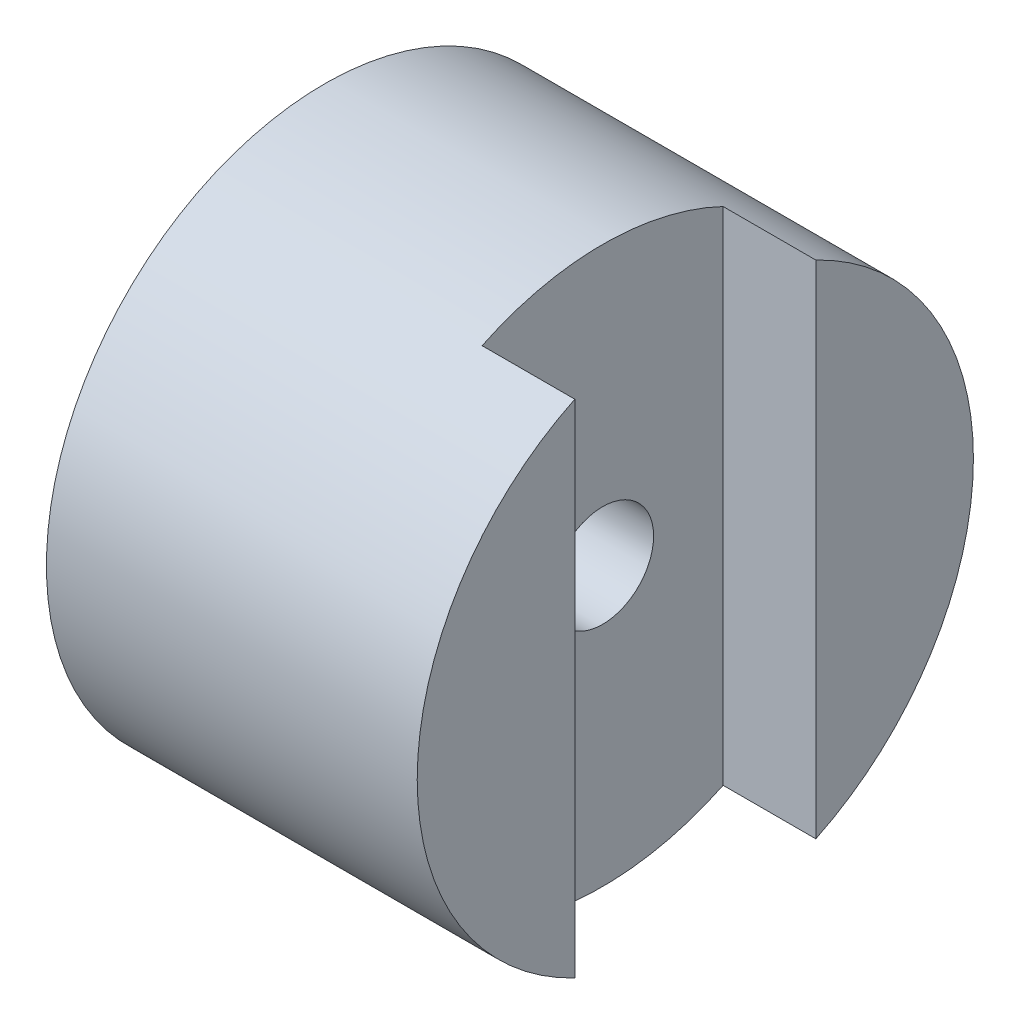
ISO-10303-21;
HEADER;
FILE_DESCRIPTION(('STEP AP214'),'2;1');
FILE_NAME('part.step','',(''),(''),'','','');
FILE_SCHEMA(('AUTOMOTIVE_DESIGN { 1 0 10303 214 1 1 1 1 }'));
ENDSEC;
DATA;
#1=APPLICATION_CONTEXT('core data for automotive mechanical design processes');
#2=APPLICATION_PROTOCOL_DEFINITION('international standard','automotive_design',2000,#1);
#3=PRODUCT_CONTEXT('',#1,'mechanical');
#4=PRODUCT('Part','Part','',(#3));
#5=PRODUCT_RELATED_PRODUCT_CATEGORY('part','',(#4));
#6=PRODUCT_DEFINITION_FORMATION('','',#4);
#7=PRODUCT_DEFINITION_CONTEXT('part definition',#1,'design');
#8=PRODUCT_DEFINITION('design','',#6,#7);
#9=PRODUCT_DEFINITION_SHAPE('','',#8);
#10=(LENGTH_UNIT() NAMED_UNIT(*) SI_UNIT(.MILLI.,.METRE.));
#11=(NAMED_UNIT(*) PLANE_ANGLE_UNIT() SI_UNIT($,.RADIAN.));
#12=(NAMED_UNIT(*) SI_UNIT($,.STERADIAN.) SOLID_ANGLE_UNIT());
#13=UNCERTAINTY_MEASURE_WITH_UNIT(LENGTH_MEASURE(1.E-05),#10,'distance_accuracy_value','');
#14=(GEOMETRIC_REPRESENTATION_CONTEXT(3) GLOBAL_UNCERTAINTY_ASSIGNED_CONTEXT((#13)) GLOBAL_UNIT_ASSIGNED_CONTEXT((#10,
#11,#12)) REPRESENTATION_CONTEXT('',''));
#15=CARTESIAN_POINT('',(0.,0.,0.));
#16=DIRECTION('',(0.,0.,1.));
#17=DIRECTION('',(1.,0.,0.));
#18=AXIS2_PLACEMENT_3D('',#15,#16,#17);
#19=CARTESIAN_POINT('',(0.,0.,0.));
#20=DIRECTION('',(1.,0.,0.));
#21=DIRECTION('',(0.,0.,-1.));
#22=AXIS2_PLACEMENT_3D('',#19,#20,#21);
#23=PLANE('',#22);
#24=CARTESIAN_POINT('',(0.,0.,0.));
#25=DIRECTION('',(1.,0.,0.));
#26=DIRECTION('',(0.,0.,-1.));
#27=AXIS2_PLACEMENT_3D('',#24,#25,#26);
#28=CIRCLE('',#27,1.1);
#29=CARTESIAN_POINT('',(0.,0.,-1.1));
#30=VERTEX_POINT('',#29);
#31=EDGE_CURVE('E127',#30,#30,#28,.T.);
#32=ORIENTED_EDGE('',*,*,#31,.F.);
#33=EDGE_LOOP('',(#32));
#34=FACE_BOUND('',#33,.T.);
#35=CARTESIAN_POINT('',(0.,0.,0.));
#36=DIRECTION('',(1.,0.,0.));
#37=DIRECTION('',(0.,0.,-1.));
#38=AXIS2_PLACEMENT_3D('',#35,#36,#37);
#39=CIRCLE('',#38,6.);
#40=CARTESIAN_POINT('',(0.,-5.40740233383831,2.6));
#41=VERTEX_POINT('',#40);
#42=CARTESIAN_POINT('',(0.,-5.40740233383831,-2.6));
#43=VERTEX_POINT('',#42);
#44=EDGE_CURVE('E36',#41,#43,#39,.T.);
#45=ORIENTED_EDGE('',*,*,#44,.T.);
#46=DIRECTION('',(0.,-1.,0.));
#47=VECTOR('',#46,1.);
#48=CARTESIAN_POINT('',(0.,-5.40740233383831,-2.6));
#49=LINE('',#48,#47);
#50=CARTESIAN_POINT('',(0.,5.40740233383831,-2.6));
#51=VERTEX_POINT('',#50);
#52=EDGE_CURVE('E83',#51,#43,#49,.T.);
#53=ORIENTED_EDGE('',*,*,#52,.F.);
#54=CARTESIAN_POINT('',(0.,5.40740233383831,2.6));
#55=VERTEX_POINT('',#54);
#56=EDGE_CURVE('E87',#51,#55,#39,.T.);
#57=ORIENTED_EDGE('',*,*,#56,.T.);
#58=DIRECTION('',(0.,1.,0.));
#59=VECTOR('',#58,1.);
#60=CARTESIAN_POINT('',(0.,5.40740233383831,2.6));
#61=LINE('',#60,#59);
#62=EDGE_CURVE('E55',#41,#55,#61,.T.);
#63=ORIENTED_EDGE('',*,*,#62,.F.);
#64=EDGE_LOOP('',(#45,#53,#57,#63));
#65=FACE_BOUND('',#64,.T.);
#66=ADVANCED_FACE('F32',(#34,#65),#23,.T.);
#67=CARTESIAN_POINT('',(-6.,0.,0.));
#68=DIRECTION('',(1.,0.,0.));
#69=DIRECTION('',(0.,0.,-1.));
#70=AXIS2_PLACEMENT_3D('',#67,#68,#69);
#71=CYLINDRICAL_SURFACE('',#70,6.);
#72=CARTESIAN_POINT('',(-6.,0.,0.));
#73=DIRECTION('',(1.,0.,0.));
#74=DIRECTION('',(0.,0.,-1.));
#75=AXIS2_PLACEMENT_3D('',#72,#73,#74);
#76=CIRCLE('',#75,6.);
#77=CARTESIAN_POINT('',(-6.,0.,-6.));
#78=VERTEX_POINT('',#77);
#79=EDGE_CURVE('E11',#78,#78,#76,.T.);
#80=ORIENTED_EDGE('',*,*,#79,.T.);
#81=EDGE_LOOP('',(#80));
#82=FACE_BOUND('',#81,.T.);
#83=ORIENTED_EDGE('',*,*,#44,.F.);
#84=DIRECTION('',(-1.,0.,0.));
#85=VECTOR('',#84,1.);
#86=CARTESIAN_POINT('',(2.,-5.40740233383831,2.6));
#87=LINE('',#86,#85);
#88=CARTESIAN_POINT('',(2.,-5.40740233383831,2.6));
#89=VERTEX_POINT('',#88);
#90=EDGE_CURVE('E100',#89,#41,#87,.T.);
#91=ORIENTED_EDGE('',*,*,#90,.F.);
#92=CARTESIAN_POINT('',(2.,0.,0.));
#93=DIRECTION('',(1.,0.,0.));
#94=DIRECTION('',(0.,0.,-1.));
#95=AXIS2_PLACEMENT_3D('',#92,#93,#94);
#96=CIRCLE('',#95,6.);
#97=CARTESIAN_POINT('',(2.,5.40740233383831,2.6));
#98=VERTEX_POINT('',#97);
#99=EDGE_CURVE('E89',#98,#89,#96,.T.);
#100=ORIENTED_EDGE('',*,*,#99,.F.);
#101=DIRECTION('',(-1.,0.,0.));
#102=VECTOR('',#101,1.);
#103=CARTESIAN_POINT('',(2.,5.40740233383831,2.6));
#104=LINE('',#103,#102);
#105=EDGE_CURVE('E97',#98,#55,#104,.T.);
#106=ORIENTED_EDGE('',*,*,#105,.T.);
#107=ORIENTED_EDGE('',*,*,#56,.F.);
#108=DIRECTION('',(-1.,0.,0.));
#109=VECTOR('',#108,1.);
#110=CARTESIAN_POINT('',(2.,5.40740233383831,-2.6));
#111=LINE('',#110,#109);
#112=CARTESIAN_POINT('',(2.,5.40740233383831,-2.6));
#113=VERTEX_POINT('',#112);
#114=EDGE_CURVE('E47',#113,#51,#111,.T.);
#115=ORIENTED_EDGE('',*,*,#114,.F.);
#116=CARTESIAN_POINT('',(2.,0.,0.));
#117=DIRECTION('',(1.,0.,0.));
#118=DIRECTION('',(0.,0.,1.));
#119=AXIS2_PLACEMENT_3D('',#116,#117,#118);
#120=CIRCLE('',#119,6.);
#121=CARTESIAN_POINT('',(2.,-5.40740233383831,-2.6));
#122=VERTEX_POINT('',#121);
#123=EDGE_CURVE('E79',#122,#113,#120,.T.);
#124=ORIENTED_EDGE('',*,*,#123,.F.);
#125=DIRECTION('',(-1.,0.,0.));
#126=VECTOR('',#125,1.);
#127=CARTESIAN_POINT('',(2.,-5.40740233383831,-2.6));
#128=LINE('',#127,#126);
#129=EDGE_CURVE('E76',#122,#43,#128,.T.);
#130=ORIENTED_EDGE('',*,*,#129,.T.);
#131=EDGE_LOOP('',(#83,#91,#100,#106,#107,#115,#124,#130));
#132=FACE_BOUND('',#131,.T.);
#133=ADVANCED_FACE('F34',(#82,#132),#71,.T.);
#134=CARTESIAN_POINT('',(-6.,0.,0.));
#135=DIRECTION('',(1.,0.,0.));
#136=DIRECTION('',(0.,0.,-1.));
#137=AXIS2_PLACEMENT_3D('',#134,#135,#136);
#138=PLANE('',#137);
#139=CARTESIAN_POINT('',(-6.,0.,0.));
#140=DIRECTION('',(1.,0.,0.));
#141=DIRECTION('',(0.,0.,-1.));
#142=AXIS2_PLACEMENT_3D('',#139,#140,#141);
#143=CIRCLE('',#142,1.1);
#144=CARTESIAN_POINT('',(-6.,0.,-1.1));
#145=VERTEX_POINT('',#144);
#146=EDGE_CURVE('E129',#145,#145,#143,.T.);
#147=ORIENTED_EDGE('',*,*,#146,.T.);
#148=EDGE_LOOP('',(#147));
#149=FACE_BOUND('',#148,.T.);
#150=ORIENTED_EDGE('',*,*,#79,.F.);
#151=EDGE_LOOP('',(#150));
#152=FACE_BOUND('',#151,.T.);
#153=ADVANCED_FACE('F110',(#149,#152),#138,.F.);
#154=CARTESIAN_POINT('',(2.,5.40740233383831,2.6));
#155=DIRECTION('',(0.,0.,1.));
#156=DIRECTION('',(1.,0.,0.));
#157=AXIS2_PLACEMENT_3D('',#154,#155,#156);
#158=PLANE('',#157);
#159=ORIENTED_EDGE('',*,*,#62,.T.);
#160=ORIENTED_EDGE('',*,*,#105,.F.);
#161=DIRECTION('',(0.,1.,0.));
#162=VECTOR('',#161,1.);
#163=CARTESIAN_POINT('',(2.,5.40740233383831,2.6));
#164=LINE('',#163,#162);
#165=EDGE_CURVE('E96',#89,#98,#164,.T.);
#166=ORIENTED_EDGE('',*,*,#165,.F.);
#167=ORIENTED_EDGE('',*,*,#90,.T.);
#168=EDGE_LOOP('',(#159,#160,#166,#167));
#169=FACE_BOUND('',#168,.T.);
#170=ADVANCED_FACE('F108',(#169),#158,.F.);
#171=CARTESIAN_POINT('',(2.,0.,0.));
#172=DIRECTION('',(1.,0.,0.));
#173=DIRECTION('',(0.,0.,-1.));
#174=AXIS2_PLACEMENT_3D('',#171,#172,#173);
#175=PLANE('',#174);
#176=ORIENTED_EDGE('',*,*,#99,.T.);
#177=ORIENTED_EDGE('',*,*,#165,.T.);
#178=EDGE_LOOP('',(#176,#177));
#179=FACE_BOUND('',#178,.T.);
#180=ADVANCED_FACE('F107',(#179),#175,.T.);
#181=CARTESIAN_POINT('',(2.,-5.40740233383831,-2.6));
#182=DIRECTION('',(0.,0.,-1.));
#183=DIRECTION('',(0.,1.,0.));
#184=AXIS2_PLACEMENT_3D('',#181,#182,#183);
#185=PLANE('',#184);
#186=ORIENTED_EDGE('',*,*,#52,.T.);
#187=ORIENTED_EDGE('',*,*,#129,.F.);
#188=DIRECTION('',(0.,-1.,0.));
#189=VECTOR('',#188,1.);
#190=CARTESIAN_POINT('',(2.,-5.40740233383831,-2.6));
#191=LINE('',#190,#189);
#192=EDGE_CURVE('E72',#113,#122,#191,.T.);
#193=ORIENTED_EDGE('',*,*,#192,.F.);
#194=ORIENTED_EDGE('',*,*,#114,.T.);
#195=EDGE_LOOP('',(#186,#187,#193,#194));
#196=FACE_BOUND('',#195,.T.);
#197=ADVANCED_FACE('F74',(#196),#185,.F.);
#198=CARTESIAN_POINT('',(2.,0.,0.));
#199=DIRECTION('',(-1.,0.,0.));
#200=DIRECTION('',(0.,0.,1.));
#201=AXIS2_PLACEMENT_3D('',#198,#199,#200);
#202=PLANE('',#201);
#203=ORIENTED_EDGE('',*,*,#123,.T.);
#204=ORIENTED_EDGE('',*,*,#192,.T.);
#205=EDGE_LOOP('',(#203,#204));
#206=FACE_BOUND('',#205,.T.);
#207=ADVANCED_FACE('F81',(#206),#202,.F.);
#208=CARTESIAN_POINT('',(0.,0.,0.));
#209=DIRECTION('',(1.,0.,0.));
#210=DIRECTION('',(0.,0.,-1.));
#211=AXIS2_PLACEMENT_3D('',#208,#209,#210);
#212=CYLINDRICAL_SURFACE('',#211,1.1);
#213=ORIENTED_EDGE('',*,*,#146,.F.);
#214=EDGE_LOOP('',(#213));
#215=FACE_BOUND('',#214,.T.);
#216=ORIENTED_EDGE('',*,*,#31,.T.);
#217=EDGE_LOOP('',(#216));
#218=FACE_BOUND('',#217,.T.);
#219=ADVANCED_FACE('F136',(#215,#218),#212,.F.);
#220=CLOSED_SHELL('',(#66,#133,#153,#170,#180,#197,#207,#219));
#221=MANIFOLD_SOLID_BREP('B2',#220);
#222=ADVANCED_BREP_SHAPE_REPRESENTATION('',(#18,#221),#14);
#223=SHAPE_DEFINITION_REPRESENTATION(#9,#222);
ENDSEC;
END-ISO-10303-21;
